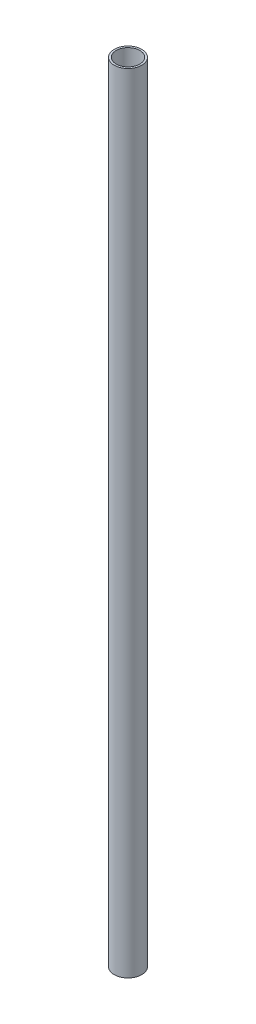
ISO-10303-21;
HEADER;
FILE_DESCRIPTION(('STEP AP214'),'2;1');
FILE_NAME('part.step','',(''),(''),'','','');
FILE_SCHEMA(('AUTOMOTIVE_DESIGN { 1 0 10303 214 1 1 1 1 }'));
ENDSEC;
DATA;
#1=APPLICATION_CONTEXT('core data for automotive mechanical design processes');
#2=APPLICATION_PROTOCOL_DEFINITION('international standard','automotive_design',2000,#1);
#3=PRODUCT_CONTEXT('',#1,'mechanical');
#4=PRODUCT('Part','Part','',(#3));
#5=PRODUCT_RELATED_PRODUCT_CATEGORY('part','',(#4));
#6=PRODUCT_DEFINITION_FORMATION('','',#4);
#7=PRODUCT_DEFINITION_CONTEXT('part definition',#1,'design');
#8=PRODUCT_DEFINITION('design','',#6,#7);
#9=PRODUCT_DEFINITION_SHAPE('','',#8);
#10=(LENGTH_UNIT() NAMED_UNIT(*) SI_UNIT(.MILLI.,.METRE.));
#11=(NAMED_UNIT(*) PLANE_ANGLE_UNIT() SI_UNIT($,.RADIAN.));
#12=(NAMED_UNIT(*) SI_UNIT($,.STERADIAN.) SOLID_ANGLE_UNIT());
#13=UNCERTAINTY_MEASURE_WITH_UNIT(LENGTH_MEASURE(1.E-05),#10,'distance_accuracy_value','');
#14=(GEOMETRIC_REPRESENTATION_CONTEXT(3) GLOBAL_UNCERTAINTY_ASSIGNED_CONTEXT((#13)) GLOBAL_UNIT_ASSIGNED_CONTEXT((#10,
#11,#12)) REPRESENTATION_CONTEXT('',''));
#15=CARTESIAN_POINT('',(0.,0.,0.));
#16=DIRECTION('',(0.,0.,1.));
#17=DIRECTION('',(1.,0.,0.));
#18=AXIS2_PLACEMENT_3D('',#15,#16,#17);
#19=CARTESIAN_POINT('',(0.,400.,0.));
#20=DIRECTION('',(0.,1.,0.));
#21=DIRECTION('',(0.,0.,1.));
#22=AXIS2_PLACEMENT_3D('',#19,#20,#21);
#23=PLANE('',#22);
#24=CARTESIAN_POINT('',(0.,400.,0.));
#25=DIRECTION('',(0.,1.,0.));
#26=DIRECTION('',(0.,0.,1.));
#27=AXIS2_PLACEMENT_3D('',#24,#25,#26);
#28=CIRCLE('',#27,7.);
#29=CARTESIAN_POINT('',(0.,400.,7.));
#30=VERTEX_POINT('',#29);
#31=EDGE_CURVE('E10',#30,#30,#28,.T.);
#32=ORIENTED_EDGE('',*,*,#31,.T.);
#33=EDGE_LOOP('',(#32));
#34=FACE_BOUND('',#33,.T.);
#35=CARTESIAN_POINT('',(0.,400.,0.));
#36=DIRECTION('',(0.,1.,0.));
#37=DIRECTION('',(0.,0.,1.));
#38=AXIS2_PLACEMENT_3D('',#35,#36,#37);
#39=CIRCLE('',#38,6.);
#40=CARTESIAN_POINT('',(0.,400.,6.));
#41=VERTEX_POINT('',#40);
#42=EDGE_CURVE('E44',#41,#41,#39,.T.);
#43=ORIENTED_EDGE('',*,*,#42,.F.);
#44=EDGE_LOOP('',(#43));
#45=FACE_BOUND('',#44,.T.);
#46=ADVANCED_FACE('F33',(#34,#45),#23,.T.);
#47=CARTESIAN_POINT('',(0.,0.,0.));
#48=DIRECTION('',(0.,1.,0.));
#49=DIRECTION('',(0.,0.,1.));
#50=AXIS2_PLACEMENT_3D('',#47,#48,#49);
#51=PLANE('',#50);
#52=CARTESIAN_POINT('',(0.,0.,0.));
#53=DIRECTION('',(0.,1.,0.));
#54=DIRECTION('',(0.,0.,1.));
#55=AXIS2_PLACEMENT_3D('',#52,#53,#54);
#56=CIRCLE('',#55,7.);
#57=CARTESIAN_POINT('',(0.,0.,7.));
#58=VERTEX_POINT('',#57);
#59=EDGE_CURVE('E37',#58,#58,#56,.T.);
#60=ORIENTED_EDGE('',*,*,#59,.F.);
#61=EDGE_LOOP('',(#60));
#62=FACE_BOUND('',#61,.T.);
#63=CARTESIAN_POINT('',(0.,0.,0.));
#64=DIRECTION('',(0.,1.,0.));
#65=DIRECTION('',(0.,0.,1.));
#66=AXIS2_PLACEMENT_3D('',#63,#64,#65);
#67=CIRCLE('',#66,6.);
#68=CARTESIAN_POINT('',(0.,0.,6.));
#69=VERTEX_POINT('',#68);
#70=EDGE_CURVE('E46',#69,#69,#67,.T.);
#71=ORIENTED_EDGE('',*,*,#70,.T.);
#72=EDGE_LOOP('',(#71));
#73=FACE_BOUND('',#72,.T.);
#74=ADVANCED_FACE('F56',(#62,#73),#51,.F.);
#75=CARTESIAN_POINT('',(0.,400.,0.));
#76=DIRECTION('',(0.,-1.,0.));
#77=DIRECTION('',(0.,0.,-1.));
#78=AXIS2_PLACEMENT_3D('',#75,#76,#77);
#79=CYLINDRICAL_SURFACE('',#78,7.);
#80=ORIENTED_EDGE('',*,*,#31,.F.);
#81=EDGE_LOOP('',(#80));
#82=FACE_BOUND('',#81,.T.);
#83=ORIENTED_EDGE('',*,*,#59,.T.);
#84=EDGE_LOOP('',(#83));
#85=FACE_BOUND('',#84,.T.);
#86=ADVANCED_FACE('F35',(#82,#85),#79,.T.);
#87=CARTESIAN_POINT('',(0.,400.,0.));
#88=DIRECTION('',(0.,-1.,0.));
#89=DIRECTION('',(0.,0.,-1.));
#90=AXIS2_PLACEMENT_3D('',#87,#88,#89);
#91=CYLINDRICAL_SURFACE('',#90,6.);
#92=ORIENTED_EDGE('',*,*,#42,.T.);
#93=EDGE_LOOP('',(#92));
#94=FACE_BOUND('',#93,.T.);
#95=ORIENTED_EDGE('',*,*,#70,.F.);
#96=EDGE_LOOP('',(#95));
#97=FACE_BOUND('',#96,.T.);
#98=ADVANCED_FACE('F52',(#94,#97),#91,.F.);
#99=CLOSED_SHELL('',(#46,#74,#86,#98));
#100=MANIFOLD_SOLID_BREP('B2',#99);
#101=ADVANCED_BREP_SHAPE_REPRESENTATION('',(#18,#100),#14);
#102=SHAPE_DEFINITION_REPRESENTATION(#9,#101);
ENDSEC;
END-ISO-10303-21;
